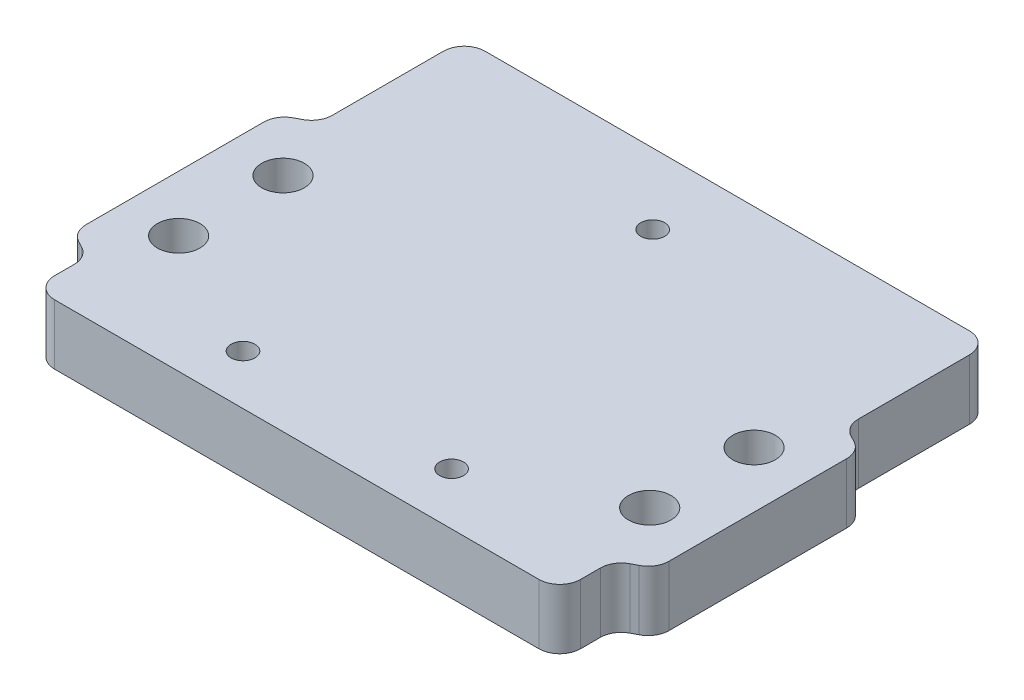
ISO-10303-21;
HEADER;
FILE_DESCRIPTION(('STEP AP214'),'2;1');
FILE_NAME('part.step','',(''),(''),'','','');
FILE_SCHEMA(('AUTOMOTIVE_DESIGN { 1 0 10303 214 1 1 1 1 }'));
ENDSEC;
DATA;
#1=APPLICATION_CONTEXT('core data for automotive mechanical design processes');
#2=APPLICATION_PROTOCOL_DEFINITION('international standard','automotive_design',2000,#1);
#3=PRODUCT_CONTEXT('',#1,'mechanical');
#4=PRODUCT('Part','Part','',(#3));
#5=PRODUCT_RELATED_PRODUCT_CATEGORY('part','',(#4));
#6=PRODUCT_DEFINITION_FORMATION('','',#4);
#7=PRODUCT_DEFINITION_CONTEXT('part definition',#1,'design');
#8=PRODUCT_DEFINITION('design','',#6,#7);
#9=PRODUCT_DEFINITION_SHAPE('','',#8);
#10=(LENGTH_UNIT() NAMED_UNIT(*) SI_UNIT(.MILLI.,.METRE.));
#11=(NAMED_UNIT(*) PLANE_ANGLE_UNIT() SI_UNIT($,.RADIAN.));
#12=(NAMED_UNIT(*) SI_UNIT($,.STERADIAN.) SOLID_ANGLE_UNIT());
#13=UNCERTAINTY_MEASURE_WITH_UNIT(LENGTH_MEASURE(1.E-05),#10,'distance_accuracy_value','');
#14=(GEOMETRIC_REPRESENTATION_CONTEXT(3) GLOBAL_UNCERTAINTY_ASSIGNED_CONTEXT((#13)) GLOBAL_UNIT_ASSIGNED_CONTEXT((#10,
#11,#12)) REPRESENTATION_CONTEXT('',''));
#15=CARTESIAN_POINT('',(0.,0.,0.));
#16=DIRECTION('',(0.,0.,1.));
#17=DIRECTION('',(1.,0.,0.));
#18=AXIS2_PLACEMENT_3D('',#15,#16,#17);
#19=CARTESIAN_POINT('',(0.,7.3152,0.));
#20=DIRECTION('',(0.,1.,0.));
#21=DIRECTION('',(0.,0.,1.));
#22=AXIS2_PLACEMENT_3D('',#19,#20,#21);
#23=PLANE('',#22);
#24=DIRECTION('',(-1.,0.,0.));
#25=VECTOR('',#24,1.);
#26=CARTESIAN_POINT('',(-36.3811986175395,7.3152,20.6430448620664));
#27=LINE('',#26,#25);
#28=CARTESIAN_POINT('',(29.4680176936611,7.3152,20.6430448620664));
#29=VERTEX_POINT('',#28);
#30=CARTESIAN_POINT('',(-29.4680176936611,7.3152,20.6430448620664));
#31=VERTEX_POINT('',#30);
#32=EDGE_CURVE('E437',#29,#31,#27,.T.);
#33=ORIENTED_EDGE('',*,*,#32,.F.);
#34=CARTESIAN_POINT('',(29.4680176936611,7.3152,18.1030448620664));
#35=DIRECTION('',(0.,1.,0.));
#36=DIRECTION('',(0.,0.,1.));
#37=AXIS2_PLACEMENT_3D('',#34,#35,#36);
#38=CIRCLE('',#37,2.54);
#39=CARTESIAN_POINT('',(32.0080176936611,7.3152,18.1030448620664));
#40=VERTEX_POINT('',#39);
#41=EDGE_CURVE('E49',#29,#40,#38,.T.);
#42=ORIENTED_EDGE('',*,*,#41,.T.);
#43=DIRECTION('',(0.,0.,1.));
#44=VECTOR('',#43,1.);
#45=CARTESIAN_POINT('',(32.0080176936611,7.3152,0.));
#46=LINE('',#45,#44);
#47=CARTESIAN_POINT('',(32.0080176936611,7.3152,15.6974481656391));
#48=VERTEX_POINT('',#47);
#49=EDGE_CURVE('E436',#48,#40,#46,.T.);
#50=ORIENTED_EDGE('',*,*,#49,.F.);
#51=CARTESIAN_POINT('',(34.5480176936611,7.3152,15.6974481656391));
#52=DIRECTION('',(0.,1.,0.));
#53=DIRECTION('',(0.,0.,1.));
#54=AXIS2_PLACEMENT_3D('',#51,#52,#53);
#55=CIRCLE('',#54,2.54);
#56=CARTESIAN_POINT('',(33.3763791541453,7.3152,13.443814847479));
#57=VERTEX_POINT('',#56);
#58=EDGE_CURVE('E382',#48,#57,#55,.F.);
#59=ORIENTED_EDGE('',*,*,#58,.T.);
#60=DIRECTION('',(-0.887257211874053,0.,0.461275015557403));
#61=VECTOR('',#60,1.);
#62=CARTESIAN_POINT('',(12.6037915711075,7.3152,24.2432488022558));
#63=LINE('',#62,#61);
#64=CARTESIAN_POINT('',(34.1044985055158,7.3152,13.0652738104085));
#65=VERTEX_POINT('',#64);
#66=EDGE_CURVE('E448',#65,#57,#63,.T.);
#67=ORIENTED_EDGE('',*,*,#66,.F.);
#68=CARTESIAN_POINT('',(32.932859966,7.3152,10.8116404922484));
#69=DIRECTION('',(0.,1.,0.));
#70=DIRECTION('',(0.,0.,1.));
#71=AXIS2_PLACEMENT_3D('',#68,#69,#70);
#72=CIRCLE('',#71,2.54);
#73=CARTESIAN_POINT('',(35.472859966,7.3152,10.8116404922484));
#74=VERTEX_POINT('',#73);
#75=EDGE_CURVE('E340',#65,#74,#72,.T.);
#76=ORIENTED_EDGE('',*,*,#75,.T.);
#77=DIRECTION('',(0.,0.,-1.));
#78=VECTOR('',#77,1.);
#79=CARTESIAN_POINT('',(35.472859966,7.3152,31.75));
#80=LINE('',#79,#78);
#81=CARTESIAN_POINT('',(35.472859966,7.3152,-10.8116404922484));
#82=VERTEX_POINT('',#81);
#83=EDGE_CURVE('E277',#74,#82,#80,.T.);
#84=ORIENTED_EDGE('',*,*,#83,.T.);
#85=CARTESIAN_POINT('',(32.932859966,7.3152,-10.8116404922484));
#86=DIRECTION('',(0.,1.,0.));
#87=DIRECTION('',(0.,0.,1.));
#88=AXIS2_PLACEMENT_3D('',#85,#86,#87);
#89=CIRCLE('',#88,2.54);
#90=CARTESIAN_POINT('',(34.1044985055158,7.3152,-13.0652738104085));
#91=VERTEX_POINT('',#90);
#92=EDGE_CURVE('E213',#82,#91,#89,.T.);
#93=ORIENTED_EDGE('',*,*,#92,.T.);
#94=DIRECTION('',(-0.887257211874053,0.,-0.461275015557403));
#95=VECTOR('',#94,1.);
#96=CARTESIAN_POINT('',(12.6037915711075,7.3152,-24.2432488022558));
#97=LINE('',#96,#95);
#98=CARTESIAN_POINT('',(33.3763791541453,7.3152,-13.443814847479));
#99=VERTEX_POINT('',#98);
#100=EDGE_CURVE('E535',#91,#99,#97,.T.);
#101=ORIENTED_EDGE('',*,*,#100,.T.);
#102=CARTESIAN_POINT('',(34.5480176936611,7.3152,-15.6974481656391));
#103=DIRECTION('',(0.,1.,0.));
#104=DIRECTION('',(0.,0.,1.));
#105=AXIS2_PLACEMENT_3D('',#102,#103,#104);
#106=CIRCLE('',#105,2.54);
#107=CARTESIAN_POINT('',(32.0080176936611,7.3152,-15.6974481656391));
#108=VERTEX_POINT('',#107);
#109=EDGE_CURVE('E330',#99,#108,#106,.F.);
#110=ORIENTED_EDGE('',*,*,#109,.T.);
#111=DIRECTION('',(0.,0.,-1.));
#112=VECTOR('',#111,1.);
#113=CARTESIAN_POINT('',(32.0080176936611,7.3152,0.));
#114=LINE('',#113,#112);
#115=CARTESIAN_POINT('',(32.0080176936611,7.3152,-29.21));
#116=VERTEX_POINT('',#115);
#117=EDGE_CURVE('E531',#108,#116,#114,.T.);
#118=ORIENTED_EDGE('',*,*,#117,.T.);
#119=CARTESIAN_POINT('',(29.4680176936611,7.3152,-29.21));
#120=DIRECTION('',(0.,1.,0.));
#121=DIRECTION('',(0.,0.,1.));
#122=AXIS2_PLACEMENT_3D('',#119,#120,#121);
#123=CIRCLE('',#122,2.54);
#124=CARTESIAN_POINT('',(29.4680176936611,7.3152,-31.75));
#125=VERTEX_POINT('',#124);
#126=EDGE_CURVE('E395',#116,#125,#123,.T.);
#127=ORIENTED_EDGE('',*,*,#126,.T.);
#128=DIRECTION('',(-1.,0.,0.));
#129=VECTOR('',#128,1.);
#130=CARTESIAN_POINT('',(35.472859966,7.3152,-31.75));
#131=LINE('',#130,#129);
#132=CARTESIAN_POINT('',(-29.468017693661,7.3152,-31.75));
#133=VERTEX_POINT('',#132);
#134=EDGE_CURVE('E281',#125,#133,#131,.T.);
#135=ORIENTED_EDGE('',*,*,#134,.T.);
#136=CARTESIAN_POINT('',(-29.4680176936611,7.3152,-29.21));
#137=DIRECTION('',(0.,1.,0.));
#138=DIRECTION('',(0.,0.,1.));
#139=AXIS2_PLACEMENT_3D('',#136,#137,#138);
#140=CIRCLE('',#139,2.54);
#141=CARTESIAN_POINT('',(-32.0080176936611,7.3152,-29.21));
#142=VERTEX_POINT('',#141);
#143=EDGE_CURVE('E392',#133,#142,#140,.T.);
#144=ORIENTED_EDGE('',*,*,#143,.T.);
#145=DIRECTION('',(0.,0.,-1.));
#146=VECTOR('',#145,1.);
#147=CARTESIAN_POINT('',(-32.0080176936611,7.3152,0.));
#148=LINE('',#147,#146);
#149=CARTESIAN_POINT('',(-32.0080176936611,7.3152,-15.6974481656391));
#150=VERTEX_POINT('',#149);
#151=EDGE_CURVE('E230',#150,#142,#148,.T.);
#152=ORIENTED_EDGE('',*,*,#151,.F.);
#153=CARTESIAN_POINT('',(-34.5480176936611,7.3152,-15.6974481656391));
#154=DIRECTION('',(0.,1.,0.));
#155=DIRECTION('',(0.,0.,1.));
#156=AXIS2_PLACEMENT_3D('',#153,#154,#155);
#157=CIRCLE('',#156,2.54);
#158=CARTESIAN_POINT('',(-33.3763791541453,7.3152,-13.443814847479));
#159=VERTEX_POINT('',#158);
#160=EDGE_CURVE('E228',#150,#159,#157,.F.);
#161=ORIENTED_EDGE('',*,*,#160,.T.);
#162=DIRECTION('',(0.887257211874053,0.,-0.461275015557403));
#163=VECTOR('',#162,1.);
#164=CARTESIAN_POINT('',(-12.6037915711075,7.3152,-24.2432488022558));
#165=LINE('',#164,#163);
#166=CARTESIAN_POINT('',(-34.1044985055158,7.3152,-13.0652738104085));
#167=VERTEX_POINT('',#166);
#168=EDGE_CURVE('E219',#167,#159,#165,.T.);
#169=ORIENTED_EDGE('',*,*,#168,.F.);
#170=CARTESIAN_POINT('',(-32.932859966,7.3152,-10.8116404922484));
#171=DIRECTION('',(0.,1.,0.));
#172=DIRECTION('',(0.,0.,1.));
#173=AXIS2_PLACEMENT_3D('',#170,#171,#172);
#174=CIRCLE('',#173,2.54);
#175=CARTESIAN_POINT('',(-35.472859966,7.3152,-10.8116404922484));
#176=VERTEX_POINT('',#175);
#177=EDGE_CURVE('E203',#167,#176,#174,.T.);
#178=ORIENTED_EDGE('',*,*,#177,.T.);
#179=DIRECTION('',(0.,0.,1.));
#180=VECTOR('',#179,1.);
#181=CARTESIAN_POINT('',(-35.472859966,7.3152,31.75));
#182=LINE('',#181,#180);
#183=CARTESIAN_POINT('',(-35.472859966,7.3152,10.8116404922484));
#184=VERTEX_POINT('',#183);
#185=EDGE_CURVE('E274',#176,#184,#182,.T.);
#186=ORIENTED_EDGE('',*,*,#185,.T.);
#187=CARTESIAN_POINT('',(-32.932859966,7.3152,10.8116404922484));
#188=DIRECTION('',(0.,1.,0.));
#189=DIRECTION('',(0.,0.,1.));
#190=AXIS2_PLACEMENT_3D('',#187,#188,#189);
#191=CIRCLE('',#190,2.54);
#192=CARTESIAN_POINT('',(-34.1044985055158,7.3152,13.0652738104085));
#193=VERTEX_POINT('',#192);
#194=EDGE_CURVE('E343',#184,#193,#191,.T.);
#195=ORIENTED_EDGE('',*,*,#194,.T.);
#196=DIRECTION('',(0.887257211874053,0.,0.461275015557403));
#197=VECTOR('',#196,1.);
#198=CARTESIAN_POINT('',(-12.6037915711075,7.3152,24.2432488022558));
#199=LINE('',#198,#197);
#200=CARTESIAN_POINT('',(-33.3763791541453,7.3152,13.443814847479));
#201=VERTEX_POINT('',#200);
#202=EDGE_CURVE('E519',#193,#201,#199,.T.);
#203=ORIENTED_EDGE('',*,*,#202,.T.);
#204=CARTESIAN_POINT('',(-34.5480176936611,7.3152,15.6974481656391));
#205=DIRECTION('',(0.,1.,0.));
#206=DIRECTION('',(0.,0.,1.));
#207=AXIS2_PLACEMENT_3D('',#204,#205,#206);
#208=CIRCLE('',#207,2.54);
#209=CARTESIAN_POINT('',(-32.0080176936611,7.3152,15.6974481656391));
#210=VERTEX_POINT('',#209);
#211=EDGE_CURVE('E376',#201,#210,#208,.F.);
#212=ORIENTED_EDGE('',*,*,#211,.T.);
#213=DIRECTION('',(0.,0.,1.));
#214=VECTOR('',#213,1.);
#215=CARTESIAN_POINT('',(-32.0080176936611,7.3152,0.));
#216=LINE('',#215,#214);
#217=CARTESIAN_POINT('',(-32.0080176936611,7.3152,18.1030448620664));
#218=VERTEX_POINT('',#217);
#219=EDGE_CURVE('E516',#210,#218,#216,.T.);
#220=ORIENTED_EDGE('',*,*,#219,.T.);
#221=CARTESIAN_POINT('',(-29.4680176936611,7.3152,18.1030448620664));
#222=DIRECTION('',(0.,1.,0.));
#223=DIRECTION('',(0.,0.,1.));
#224=AXIS2_PLACEMENT_3D('',#221,#222,#223);
#225=CIRCLE('',#224,2.54);
#226=EDGE_CURVE('E61',#218,#31,#225,.T.);
#227=ORIENTED_EDGE('',*,*,#226,.T.);
#228=EDGE_LOOP('',(#33,#42,#50,#59,#67,#76,#84,#93,#101,#110,#118,#127,#135,#144,#152,#161,#169,
#178,#186,#195,#203,#212,#220,#227));
#229=FACE_BOUND('',#228,.T.);
#230=CARTESIAN_POINT('',(12.4986960237432,7.3152,14.3011286735226));
#231=DIRECTION('',(0.,-1.,0.));
#232=DIRECTION('',(0.,0.,-1.));
#233=AXIS2_PLACEMENT_3D('',#230,#231,#232);
#234=CIRCLE('',#233,1.45);
#235=CARTESIAN_POINT('',(12.4986960237432,7.3152,12.8511286735226));
#236=VERTEX_POINT('',#235);
#237=EDGE_CURVE('E473',#236,#236,#234,.T.);
#238=ORIENTED_EDGE('',*,*,#237,.T.);
#239=EDGE_LOOP('',(#238));
#240=FACE_BOUND('',#239,.T.);
#241=CARTESIAN_POINT('',(-12.59967499821,7.3152,14.5870867899943));
#242=DIRECTION('',(0.,-1.,0.));
#243=DIRECTION('',(0.,0.,-1.));
#244=AXIS2_PLACEMENT_3D('',#241,#242,#243);
#245=CIRCLE('',#244,1.45);
#246=CARTESIAN_POINT('',(-12.59967499821,7.3152,13.1370867899943));
#247=VERTEX_POINT('',#246);
#248=EDGE_CURVE('E485',#247,#247,#245,.T.);
#249=ORIENTED_EDGE('',*,*,#248,.T.);
#250=EDGE_LOOP('',(#249));
#251=FACE_BOUND('',#250,.T.);
#252=CARTESIAN_POINT('',(-0.478857024258712,7.3152,-23.1534520461477));
#253=DIRECTION('',(0.,-1.,0.));
#254=DIRECTION('',(0.,0.,-1.));
#255=AXIS2_PLACEMENT_3D('',#252,#253,#254);
#256=CIRCLE('',#255,1.45);
#257=CARTESIAN_POINT('',(-0.478857024258712,7.3152,-24.6034520461477));
#258=VERTEX_POINT('',#257);
#259=EDGE_CURVE('E497',#258,#258,#256,.T.);
#260=ORIENTED_EDGE('',*,*,#259,.T.);
#261=EDGE_LOOP('',(#260));
#262=FACE_BOUND('',#261,.T.);
#263=CARTESIAN_POINT('',(28.662459966,7.3152,6.35));
#264=DIRECTION('',(0.,1.,0.));
#265=DIRECTION('',(0.,0.,1.));
#266=AXIS2_PLACEMENT_3D('',#263,#264,#265);
#267=CIRCLE('',#266,2.59079999999999);
#268=CARTESIAN_POINT('',(28.662459966,7.3152,8.94079999999999));
#269=VERTEX_POINT('',#268);
#270=EDGE_CURVE('E236',#269,#269,#267,.T.);
#271=ORIENTED_EDGE('',*,*,#270,.F.);
#272=EDGE_LOOP('',(#271));
#273=FACE_BOUND('',#272,.T.);
#274=CARTESIAN_POINT('',(28.662459966,7.3152,-6.35));
#275=DIRECTION('',(0.,1.,0.));
#276=DIRECTION('',(0.,0.,1.));
#277=AXIS2_PLACEMENT_3D('',#274,#275,#276);
#278=CIRCLE('',#277,2.59079999999999);
#279=CARTESIAN_POINT('',(28.662459966,7.3152,-3.75920000000001));
#280=VERTEX_POINT('',#279);
#281=EDGE_CURVE('E249',#280,#280,#278,.T.);
#282=ORIENTED_EDGE('',*,*,#281,.F.);
#283=EDGE_LOOP('',(#282));
#284=FACE_BOUND('',#283,.T.);
#285=CARTESIAN_POINT('',(-28.662459966,7.3152,6.35));
#286=DIRECTION('',(0.,1.,0.));
#287=DIRECTION('',(0.,0.,1.));
#288=AXIS2_PLACEMENT_3D('',#285,#286,#287);
#289=CIRCLE('',#288,2.59079999999999);
#290=CARTESIAN_POINT('',(-28.662459966,7.3152,8.94079999999999));
#291=VERTEX_POINT('',#290);
#292=EDGE_CURVE('E257',#291,#291,#289,.T.);
#293=ORIENTED_EDGE('',*,*,#292,.F.);
#294=EDGE_LOOP('',(#293));
#295=FACE_BOUND('',#294,.T.);
#296=CARTESIAN_POINT('',(-28.662459966,7.3152,-6.35));
#297=DIRECTION('',(0.,1.,0.));
#298=DIRECTION('',(0.,0.,1.));
#299=AXIS2_PLACEMENT_3D('',#296,#297,#298);
#300=CIRCLE('',#299,2.59079999999999);
#301=CARTESIAN_POINT('',(-28.662459966,7.3152,-3.75920000000001));
#302=VERTEX_POINT('',#301);
#303=EDGE_CURVE('E265',#302,#302,#300,.T.);
#304=ORIENTED_EDGE('',*,*,#303,.F.);
#305=EDGE_LOOP('',(#304));
#306=FACE_BOUND('',#305,.T.);
#307=ADVANCED_FACE('F40',(#229,#240,#251,#262,#273,#284,#295,#306),#23,.T.);
#308=CARTESIAN_POINT('',(0.,0.,0.));
#309=DIRECTION('',(0.,1.,0.));
#310=DIRECTION('',(0.,0.,1.));
#311=AXIS2_PLACEMENT_3D('',#308,#309,#310);
#312=PLANE('',#311);
#313=CARTESIAN_POINT('',(12.4986960237432,0.,14.3011286735226));
#314=DIRECTION('',(0.,-1.,0.));
#315=DIRECTION('',(0.,0.,-1.));
#316=AXIS2_PLACEMENT_3D('',#313,#314,#315);
#317=CIRCLE('',#316,2.75);
#318=CARTESIAN_POINT('',(12.4986960237432,0.,11.5511286735226));
#319=VERTEX_POINT('',#318);
#320=EDGE_CURVE('E461',#319,#319,#317,.T.);
#321=ORIENTED_EDGE('',*,*,#320,.F.);
#322=EDGE_LOOP('',(#321));
#323=FACE_BOUND('',#322,.T.);
#324=CARTESIAN_POINT('',(-12.59967499821,0.,14.5870867899943));
#325=DIRECTION('',(0.,-1.,0.));
#326=DIRECTION('',(0.,0.,-1.));
#327=AXIS2_PLACEMENT_3D('',#324,#325,#326);
#328=CIRCLE('',#327,2.75);
#329=CARTESIAN_POINT('',(-12.59967499821,0.,11.8370867899943));
#330=VERTEX_POINT('',#329);
#331=EDGE_CURVE('E477',#330,#330,#328,.T.);
#332=ORIENTED_EDGE('',*,*,#331,.F.);
#333=EDGE_LOOP('',(#332));
#334=FACE_BOUND('',#333,.T.);
#335=CARTESIAN_POINT('',(-0.478857024258712,0.,-23.1534520461477));
#336=DIRECTION('',(0.,-1.,0.));
#337=DIRECTION('',(0.,0.,-1.));
#338=AXIS2_PLACEMENT_3D('',#335,#336,#337);
#339=CIRCLE('',#338,2.75);
#340=CARTESIAN_POINT('',(-0.478857024258712,0.,-25.9034520461477));
#341=VERTEX_POINT('',#340);
#342=EDGE_CURVE('E489',#341,#341,#339,.T.);
#343=ORIENTED_EDGE('',*,*,#342,.F.);
#344=EDGE_LOOP('',(#343));
#345=FACE_BOUND('',#344,.T.);
#346=CARTESIAN_POINT('',(28.662459966,0.,6.35));
#347=DIRECTION('',(0.,1.,0.));
#348=DIRECTION('',(0.,0.,1.));
#349=AXIS2_PLACEMENT_3D('',#346,#347,#348);
#350=CIRCLE('',#349,2.5908);
#351=CARTESIAN_POINT('',(28.662459966,0.,8.9408));
#352=VERTEX_POINT('',#351);
#353=EDGE_CURVE('E245',#352,#352,#350,.T.);
#354=ORIENTED_EDGE('',*,*,#353,.T.);
#355=EDGE_LOOP('',(#354));
#356=FACE_BOUND('',#355,.T.);
#357=CARTESIAN_POINT('',(28.662459966,0.,-6.35));
#358=DIRECTION('',(0.,1.,0.));
#359=DIRECTION('',(0.,0.,1.));
#360=AXIS2_PLACEMENT_3D('',#357,#358,#359);
#361=CIRCLE('',#360,2.5908);
#362=CARTESIAN_POINT('',(28.662459966,0.,-3.7592));
#363=VERTEX_POINT('',#362);
#364=EDGE_CURVE('E253',#363,#363,#361,.T.);
#365=ORIENTED_EDGE('',*,*,#364,.T.);
#366=EDGE_LOOP('',(#365));
#367=FACE_BOUND('',#366,.T.);
#368=CARTESIAN_POINT('',(-28.662459966,0.,6.35));
#369=DIRECTION('',(0.,1.,0.));
#370=DIRECTION('',(0.,0.,1.));
#371=AXIS2_PLACEMENT_3D('',#368,#369,#370);
#372=CIRCLE('',#371,2.5908);
#373=CARTESIAN_POINT('',(-28.662459966,0.,8.9408));
#374=VERTEX_POINT('',#373);
#375=EDGE_CURVE('E261',#374,#374,#372,.T.);
#376=ORIENTED_EDGE('',*,*,#375,.T.);
#377=EDGE_LOOP('',(#376));
#378=FACE_BOUND('',#377,.T.);
#379=CARTESIAN_POINT('',(-28.662459966,0.,-6.35));
#380=DIRECTION('',(0.,1.,0.));
#381=DIRECTION('',(0.,0.,1.));
#382=AXIS2_PLACEMENT_3D('',#379,#380,#381);
#383=CIRCLE('',#382,2.5908);
#384=CARTESIAN_POINT('',(-28.662459966,0.,-3.7592));
#385=VERTEX_POINT('',#384);
#386=EDGE_CURVE('E269',#385,#385,#383,.T.);
#387=ORIENTED_EDGE('',*,*,#386,.T.);
#388=EDGE_LOOP('',(#387));
#389=FACE_BOUND('',#388,.T.);
#390=DIRECTION('',(0.,0.,1.));
#391=VECTOR('',#390,1.);
#392=CARTESIAN_POINT('',(32.0080176936611,0.,14.1552105346888));
#393=LINE('',#392,#391);
#394=CARTESIAN_POINT('',(32.0080176936611,0.,15.6974481656391));
#395=VERTEX_POINT('',#394);
#396=CARTESIAN_POINT('',(32.0080176936611,0.,18.1030448620664));
#397=VERTEX_POINT('',#396);
#398=EDGE_CURVE('E456',#395,#397,#393,.T.);
#399=ORIENTED_EDGE('',*,*,#398,.T.);
#400=CARTESIAN_POINT('',(29.4680176936611,0.,18.1030448620664));
#401=DIRECTION('',(0.,1.,0.));
#402=DIRECTION('',(0.,0.,1.));
#403=AXIS2_PLACEMENT_3D('',#400,#401,#402);
#404=CIRCLE('',#403,2.54);
#405=CARTESIAN_POINT('',(29.4680176936611,0.,20.6430448620664));
#406=VERTEX_POINT('',#405);
#407=EDGE_CURVE('E421',#397,#406,#404,.F.);
#408=ORIENTED_EDGE('',*,*,#407,.T.);
#409=DIRECTION('',(-1.,0.,0.));
#410=VECTOR('',#409,1.);
#411=CARTESIAN_POINT('',(-36.3811986175395,0.,20.6430448620664));
#412=LINE('',#411,#410);
#413=CARTESIAN_POINT('',(-29.4680176936611,0.,20.6430448620664));
#414=VERTEX_POINT('',#413);
#415=EDGE_CURVE('E455',#406,#414,#412,.T.);
#416=ORIENTED_EDGE('',*,*,#415,.T.);
#417=CARTESIAN_POINT('',(-29.4680176936611,0.,18.1030448620664));
#418=DIRECTION('',(0.,1.,0.));
#419=DIRECTION('',(0.,0.,1.));
#420=AXIS2_PLACEMENT_3D('',#417,#418,#419);
#421=CIRCLE('',#420,2.54);
#422=CARTESIAN_POINT('',(-32.0080176936611,0.,18.1030448620664));
#423=VERTEX_POINT('',#422);
#424=EDGE_CURVE('E418',#414,#423,#421,.F.);
#425=ORIENTED_EDGE('',*,*,#424,.T.);
#426=DIRECTION('',(0.,0.,1.));
#427=VECTOR('',#426,1.);
#428=CARTESIAN_POINT('',(-32.0080176936611,0.,14.1552105346888));
#429=LINE('',#428,#427);
#430=CARTESIAN_POINT('',(-32.0080176936611,0.,15.6974481656391));
#431=VERTEX_POINT('',#430);
#432=EDGE_CURVE('E447',#431,#423,#429,.T.);
#433=ORIENTED_EDGE('',*,*,#432,.F.);
#434=CARTESIAN_POINT('',(-34.5480176936611,0.,15.6974481656391));
#435=DIRECTION('',(0.,1.,0.));
#436=DIRECTION('',(0.,0.,1.));
#437=AXIS2_PLACEMENT_3D('',#434,#435,#436);
#438=CIRCLE('',#437,2.54);
#439=CARTESIAN_POINT('',(-33.3763791541453,0.,13.443814847479));
#440=VERTEX_POINT('',#439);
#441=EDGE_CURVE('E379',#431,#440,#438,.T.);
#442=ORIENTED_EDGE('',*,*,#441,.T.);
#443=DIRECTION('',(0.887257211874052,0.,0.461275015557403));
#444=VECTOR('',#443,1.);
#445=CARTESIAN_POINT('',(-35.472859966,0.,12.3538781231987));
#446=LINE('',#445,#444);
#447=CARTESIAN_POINT('',(-34.1044985055158,0.,13.0652738104085));
#448=VERTEX_POINT('',#447);
#449=EDGE_CURVE('E512',#448,#440,#446,.T.);
#450=ORIENTED_EDGE('',*,*,#449,.F.);
#451=CARTESIAN_POINT('',(-32.932859966,0.,10.8116404922484));
#452=DIRECTION('',(0.,1.,0.));
#453=DIRECTION('',(0.,0.,1.));
#454=AXIS2_PLACEMENT_3D('',#451,#452,#453);
#455=CIRCLE('',#454,2.54);
#456=CARTESIAN_POINT('',(-35.472859966,0.,10.8116404922484));
#457=VERTEX_POINT('',#456);
#458=EDGE_CURVE('E356',#448,#457,#455,.F.);
#459=ORIENTED_EDGE('',*,*,#458,.T.);
#460=DIRECTION('',(0.,0.,1.));
#461=VECTOR('',#460,1.);
#462=CARTESIAN_POINT('',(-35.472859966,0.,31.75));
#463=LINE('',#462,#461);
#464=CARTESIAN_POINT('',(-35.472859966,0.,-10.8116404922484));
#465=VERTEX_POINT('',#464);
#466=EDGE_CURVE('E273',#465,#457,#463,.T.);
#467=ORIENTED_EDGE('',*,*,#466,.F.);
#468=CARTESIAN_POINT('',(-32.932859966,0.,-10.8116404922484));
#469=DIRECTION('',(0.,1.,0.));
#470=DIRECTION('',(0.,0.,1.));
#471=AXIS2_PLACEMENT_3D('',#468,#469,#470);
#472=CIRCLE('',#471,2.54);
#473=CARTESIAN_POINT('',(-34.1044985055158,0.,-13.0652738104085));
#474=VERTEX_POINT('',#473);
#475=EDGE_CURVE('E304',#465,#474,#472,.F.);
#476=ORIENTED_EDGE('',*,*,#475,.T.);
#477=DIRECTION('',(0.887257211874052,0.,-0.461275015557403));
#478=VECTOR('',#477,1.);
#479=CARTESIAN_POINT('',(-35.472859966,0.,-12.3538781231987));
#480=LINE('',#479,#478);
#481=CARTESIAN_POINT('',(-33.3763791541453,0.,-13.443814847479));
#482=VERTEX_POINT('',#481);
#483=EDGE_CURVE('E222',#474,#482,#480,.T.);
#484=ORIENTED_EDGE('',*,*,#483,.T.);
#485=CARTESIAN_POINT('',(-34.5480176936611,0.,-15.6974481656391));
#486=DIRECTION('',(0.,1.,0.));
#487=DIRECTION('',(0.,0.,1.));
#488=AXIS2_PLACEMENT_3D('',#485,#486,#487);
#489=CIRCLE('',#488,2.54);
#490=CARTESIAN_POINT('',(-32.0080176936611,0.,-15.6974481656391));
#491=VERTEX_POINT('',#490);
#492=EDGE_CURVE('E327',#482,#491,#489,.T.);
#493=ORIENTED_EDGE('',*,*,#492,.T.);
#494=DIRECTION('',(0.,0.,-1.));
#495=VECTOR('',#494,1.);
#496=CARTESIAN_POINT('',(-32.0080176936611,0.,-14.1552105346888));
#497=LINE('',#496,#495);
#498=CARTESIAN_POINT('',(-32.0080176936611,0.,-29.21));
#499=VERTEX_POINT('',#498);
#500=EDGE_CURVE('E231',#491,#499,#497,.T.);
#501=ORIENTED_EDGE('',*,*,#500,.T.);
#502=CARTESIAN_POINT('',(-29.4680176936611,0.,-29.21));
#503=DIRECTION('',(0.,1.,0.));
#504=DIRECTION('',(0.,0.,1.));
#505=AXIS2_PLACEMENT_3D('',#502,#503,#504);
#506=CIRCLE('',#505,2.54);
#507=CARTESIAN_POINT('',(-29.468017693661,0.,-31.75));
#508=VERTEX_POINT('',#507);
#509=EDGE_CURVE('E405',#499,#508,#506,.F.);
#510=ORIENTED_EDGE('',*,*,#509,.T.);
#511=DIRECTION('',(-1.,0.,0.));
#512=VECTOR('',#511,1.);
#513=CARTESIAN_POINT('',(35.472859966,0.,-31.75));
#514=LINE('',#513,#512);
#515=CARTESIAN_POINT('',(29.4680176936611,0.,-31.75));
#516=VERTEX_POINT('',#515);
#517=EDGE_CURVE('E278',#516,#508,#514,.T.);
#518=ORIENTED_EDGE('',*,*,#517,.F.);
#519=CARTESIAN_POINT('',(29.4680176936611,0.,-29.21));
#520=DIRECTION('',(0.,1.,0.));
#521=DIRECTION('',(0.,0.,1.));
#522=AXIS2_PLACEMENT_3D('',#519,#520,#521);
#523=CIRCLE('',#522,2.54);
#524=CARTESIAN_POINT('',(32.0080176936611,0.,-29.21));
#525=VERTEX_POINT('',#524);
#526=EDGE_CURVE('E408',#516,#525,#523,.F.);
#527=ORIENTED_EDGE('',*,*,#526,.T.);
#528=DIRECTION('',(0.,0.,-1.));
#529=VECTOR('',#528,1.);
#530=CARTESIAN_POINT('',(32.0080176936611,0.,-14.1552105346888));
#531=LINE('',#530,#529);
#532=CARTESIAN_POINT('',(32.0080176936611,0.,-15.6974481656391));
#533=VERTEX_POINT('',#532);
#534=EDGE_CURVE('E523',#533,#525,#531,.T.);
#535=ORIENTED_EDGE('',*,*,#534,.F.);
#536=CARTESIAN_POINT('',(34.5480176936611,0.,-15.6974481656391));
#537=DIRECTION('',(0.,1.,0.));
#538=DIRECTION('',(0.,0.,1.));
#539=AXIS2_PLACEMENT_3D('',#536,#537,#538);
#540=CIRCLE('',#539,2.54);
#541=CARTESIAN_POINT('',(33.3763791541453,0.,-13.443814847479));
#542=VERTEX_POINT('',#541);
#543=EDGE_CURVE('E333',#533,#542,#540,.T.);
#544=ORIENTED_EDGE('',*,*,#543,.T.);
#545=DIRECTION('',(-0.887257211874052,0.,-0.461275015557403));
#546=VECTOR('',#545,1.);
#547=CARTESIAN_POINT('',(35.472859966,0.,-12.3538781231987));
#548=LINE('',#547,#546);
#549=CARTESIAN_POINT('',(34.1044985055158,0.,-13.0652738104085));
#550=VERTEX_POINT('',#549);
#551=EDGE_CURVE('E527',#550,#542,#548,.T.);
#552=ORIENTED_EDGE('',*,*,#551,.F.);
#553=CARTESIAN_POINT('',(32.932859966,0.,-10.8116404922484));
#554=DIRECTION('',(0.,1.,0.));
#555=DIRECTION('',(0.,0.,1.));
#556=AXIS2_PLACEMENT_3D('',#553,#554,#555);
#557=CIRCLE('',#556,2.54);
#558=CARTESIAN_POINT('',(35.472859966,0.,-10.8116404922484));
#559=VERTEX_POINT('',#558);
#560=EDGE_CURVE('E300',#550,#559,#557,.F.);
#561=ORIENTED_EDGE('',*,*,#560,.T.);
#562=DIRECTION('',(0.,0.,-1.));
#563=VECTOR('',#562,1.);
#564=CARTESIAN_POINT('',(35.472859966,0.,31.75));
#565=LINE('',#564,#563);
#566=CARTESIAN_POINT('',(35.472859966,0.,10.8116404922484));
#567=VERTEX_POINT('',#566);
#568=EDGE_CURVE('E288',#567,#559,#565,.T.);
#569=ORIENTED_EDGE('',*,*,#568,.F.);
#570=CARTESIAN_POINT('',(32.932859966,0.,10.8116404922484));
#571=DIRECTION('',(0.,1.,0.));
#572=DIRECTION('',(0.,0.,1.));
#573=AXIS2_PLACEMENT_3D('',#570,#571,#572);
#574=CIRCLE('',#573,2.54);
#575=CARTESIAN_POINT('',(34.1044985055158,0.,13.0652738104085));
#576=VERTEX_POINT('',#575);
#577=EDGE_CURVE('E353',#567,#576,#574,.F.);
#578=ORIENTED_EDGE('',*,*,#577,.T.);
#579=DIRECTION('',(-0.887257211874052,0.,0.461275015557403));
#580=VECTOR('',#579,1.);
#581=CARTESIAN_POINT('',(35.472859966,0.,12.3538781231987));
#582=LINE('',#581,#580);
#583=CARTESIAN_POINT('',(33.3763791541453,0.,13.443814847479));
#584=VERTEX_POINT('',#583);
#585=EDGE_CURVE('E501',#576,#584,#582,.T.);
#586=ORIENTED_EDGE('',*,*,#585,.T.);
#587=CARTESIAN_POINT('',(34.5480176936611,0.,15.6974481656391));
#588=DIRECTION('',(0.,1.,0.));
#589=DIRECTION('',(0.,0.,1.));
#590=AXIS2_PLACEMENT_3D('',#587,#588,#589);
#591=CIRCLE('',#590,2.54);
#592=EDGE_CURVE('E385',#584,#395,#591,.T.);
#593=ORIENTED_EDGE('',*,*,#592,.T.);
#594=EDGE_LOOP('',(#399,#408,#416,#425,#433,#442,#450,#459,#467,#476,#484,#493,#501,#510,#518,
#527,#535,#544,#552,#561,#569,#578,#586,#593));
#595=FACE_BOUND('',#594,.T.);
#596=ADVANCED_FACE('F454',(#323,#334,#345,#356,#367,#378,#389,#595),#312,.F.);
#597=CARTESIAN_POINT('',(-35.472859966,7.3152,31.75));
#598=DIRECTION('',(1.,0.,0.));
#599=DIRECTION('',(0.,0.,-1.));
#600=AXIS2_PLACEMENT_3D('',#597,#598,#599);
#601=PLANE('',#600);
#602=ORIENTED_EDGE('',*,*,#466,.T.);
#603=DIRECTION('',(0.,1.,0.));
#604=VECTOR('',#603,1.);
#605=CARTESIAN_POINT('',(-35.472859966,7.3152,10.8116404922484));
#606=LINE('',#605,#604);
#607=EDGE_CURVE('E336',#457,#184,#606,.T.);
#608=ORIENTED_EDGE('',*,*,#607,.T.);
#609=ORIENTED_EDGE('',*,*,#185,.F.);
#610=DIRECTION('',(0.,1.,0.));
#611=VECTOR('',#610,1.);
#612=CARTESIAN_POINT('',(-35.472859966,7.3152,-10.8116404922484));
#613=LINE('',#612,#611);
#614=EDGE_CURVE('E208',#176,#465,#613,.F.);
#615=ORIENTED_EDGE('',*,*,#614,.T.);
#616=EDGE_LOOP('',(#602,#608,#609,#615));
#617=FACE_BOUND('',#616,.T.);
#618=ADVANCED_FACE('F616',(#617),#601,.F.);
#619=CARTESIAN_POINT('',(35.472859966,7.3152,31.75));
#620=DIRECTION('',(-1.,0.,0.));
#621=DIRECTION('',(0.,0.,1.));
#622=AXIS2_PLACEMENT_3D('',#619,#620,#621);
#623=PLANE('',#622);
#624=ORIENTED_EDGE('',*,*,#83,.F.);
#625=DIRECTION('',(0.,1.,0.));
#626=VECTOR('',#625,1.);
#627=CARTESIAN_POINT('',(35.472859966,7.3152,10.8116404922484));
#628=LINE('',#627,#626);
#629=EDGE_CURVE('E369',#74,#567,#628,.F.);
#630=ORIENTED_EDGE('',*,*,#629,.T.);
#631=ORIENTED_EDGE('',*,*,#568,.T.);
#632=DIRECTION('',(0.,1.,0.));
#633=VECTOR('',#632,1.);
#634=CARTESIAN_POINT('',(35.472859966,7.3152,-10.8116404922484));
#635=LINE('',#634,#633);
#636=EDGE_CURVE('E311',#559,#82,#635,.T.);
#637=ORIENTED_EDGE('',*,*,#636,.T.);
#638=EDGE_LOOP('',(#624,#630,#631,#637));
#639=FACE_BOUND('',#638,.T.);
#640=ADVANCED_FACE('F583',(#639),#623,.F.);
#641=CARTESIAN_POINT('',(35.472859966,7.3152,-31.75));
#642=DIRECTION('',(0.,0.,1.));
#643=DIRECTION('',(1.,0.,0.));
#644=AXIS2_PLACEMENT_3D('',#641,#642,#643);
#645=PLANE('',#644);
#646=ORIENTED_EDGE('',*,*,#134,.F.);
#647=DIRECTION('',(0.,1.,0.));
#648=VECTOR('',#647,1.);
#649=CARTESIAN_POINT('',(29.4680176936611,0.,-31.75));
#650=LINE('',#649,#648);
#651=EDGE_CURVE('E402',#125,#516,#650,.F.);
#652=ORIENTED_EDGE('',*,*,#651,.T.);
#653=ORIENTED_EDGE('',*,*,#517,.T.);
#654=DIRECTION('',(0.,1.,0.));
#655=VECTOR('',#654,1.);
#656=CARTESIAN_POINT('',(-29.4680176936611,7.3152,-31.75));
#657=LINE('',#656,#655);
#658=EDGE_CURVE('E398',#508,#133,#657,.T.);
#659=ORIENTED_EDGE('',*,*,#658,.T.);
#660=EDGE_LOOP('',(#646,#652,#653,#659));
#661=FACE_BOUND('',#660,.T.);
#662=ADVANCED_FACE('F554',(#661),#645,.F.);
#663=CARTESIAN_POINT('',(-28.662459966,7.3152,-6.35));
#664=DIRECTION('',(0.,1.,0.));
#665=DIRECTION('',(0.,0.,1.));
#666=AXIS2_PLACEMENT_3D('',#663,#664,#665);
#667=CYLINDRICAL_SURFACE('',#666,2.59079999999999);
#668=ORIENTED_EDGE('',*,*,#386,.F.);
#669=EDGE_LOOP('',(#668));
#670=FACE_BOUND('',#669,.T.);
#671=ORIENTED_EDGE('',*,*,#303,.T.);
#672=EDGE_LOOP('',(#671));
#673=FACE_BOUND('',#672,.T.);
#674=ADVANCED_FACE('F620',(#670,#673),#667,.F.);
#675=CARTESIAN_POINT('',(-28.662459966,7.3152,6.35));
#676=DIRECTION('',(0.,1.,0.));
#677=DIRECTION('',(0.,0.,1.));
#678=AXIS2_PLACEMENT_3D('',#675,#676,#677);
#679=CYLINDRICAL_SURFACE('',#678,2.59079999999999);
#680=ORIENTED_EDGE('',*,*,#375,.F.);
#681=EDGE_LOOP('',(#680));
#682=FACE_BOUND('',#681,.T.);
#683=ORIENTED_EDGE('',*,*,#292,.T.);
#684=EDGE_LOOP('',(#683));
#685=FACE_BOUND('',#684,.T.);
#686=ADVANCED_FACE('F718',(#682,#685),#679,.F.);
#687=CARTESIAN_POINT('',(28.662459966,7.3152,-6.35));
#688=DIRECTION('',(0.,1.,0.));
#689=DIRECTION('',(0.,0.,1.));
#690=AXIS2_PLACEMENT_3D('',#687,#688,#689);
#691=CYLINDRICAL_SURFACE('',#690,2.59079999999999);
#692=ORIENTED_EDGE('',*,*,#364,.F.);
#693=EDGE_LOOP('',(#692));
#694=FACE_BOUND('',#693,.T.);
#695=ORIENTED_EDGE('',*,*,#281,.T.);
#696=EDGE_LOOP('',(#695));
#697=FACE_BOUND('',#696,.T.);
#698=ADVANCED_FACE('F715',(#694,#697),#691,.F.);
#699=CARTESIAN_POINT('',(28.662459966,7.3152,6.35));
#700=DIRECTION('',(0.,1.,0.));
#701=DIRECTION('',(0.,0.,1.));
#702=AXIS2_PLACEMENT_3D('',#699,#700,#701);
#703=CYLINDRICAL_SURFACE('',#702,2.59079999999999);
#704=ORIENTED_EDGE('',*,*,#353,.F.);
#705=EDGE_LOOP('',(#704));
#706=FACE_BOUND('',#705,.T.);
#707=ORIENTED_EDGE('',*,*,#270,.T.);
#708=EDGE_LOOP('',(#707));
#709=FACE_BOUND('',#708,.T.);
#710=ADVANCED_FACE('F710',(#706,#709),#703,.F.);
#711=CARTESIAN_POINT('',(-32.0080176936611,0.,-14.1552105346888));
#712=DIRECTION('',(1.,0.,0.));
#713=DIRECTION('',(0.,0.,-1.));
#714=AXIS2_PLACEMENT_3D('',#711,#712,#713);
#715=PLANE('',#714);
#716=ORIENTED_EDGE('',*,*,#151,.T.);
#717=DIRECTION('',(0.,1.,0.));
#718=VECTOR('',#717,1.);
#719=CARTESIAN_POINT('',(-32.0080176936611,0.,-29.21));
#720=LINE('',#719,#718);
#721=EDGE_CURVE('E411',#142,#499,#720,.F.);
#722=ORIENTED_EDGE('',*,*,#721,.T.);
#723=ORIENTED_EDGE('',*,*,#500,.F.);
#724=DIRECTION('',(0.,1.,0.));
#725=VECTOR('',#724,1.);
#726=CARTESIAN_POINT('',(-32.0080176936611,7.3152,-15.6974481656391));
#727=LINE('',#726,#725);
#728=EDGE_CURVE('E307',#491,#150,#727,.T.);
#729=ORIENTED_EDGE('',*,*,#728,.T.);
#730=EDGE_LOOP('',(#716,#722,#723,#729));
#731=FACE_BOUND('',#730,.T.);
#732=ADVANCED_FACE('F546',(#731),#715,.F.);
#733=CARTESIAN_POINT('',(-35.472859966,0.,-12.3538781231987));
#734=DIRECTION('',(0.461275015557403,0.,0.887257211874052));
#735=DIRECTION('',(0.887257211874053,0.,-0.461275015557403));
#736=AXIS2_PLACEMENT_3D('',#733,#734,#735);
#737=PLANE('',#736);
#738=ORIENTED_EDGE('',*,*,#483,.F.);
#739=DIRECTION('',(0.,1.,0.));
#740=VECTOR('',#739,1.);
#741=CARTESIAN_POINT('',(-34.1044985055158,0.,-13.0652738104085));
#742=LINE('',#741,#740);
#743=EDGE_CURVE('E207',#474,#167,#742,.T.);
#744=ORIENTED_EDGE('',*,*,#743,.T.);
#745=ORIENTED_EDGE('',*,*,#168,.T.);
#746=DIRECTION('',(0.,1.,0.));
#747=VECTOR('',#746,1.);
#748=CARTESIAN_POINT('',(-33.3763791541453,0.,-13.443814847479));
#749=LINE('',#748,#747);
#750=EDGE_CURVE('E224',#159,#482,#749,.F.);
#751=ORIENTED_EDGE('',*,*,#750,.T.);
#752=EDGE_LOOP('',(#738,#744,#745,#751));
#753=FACE_BOUND('',#752,.T.);
#754=ADVANCED_FACE('F218',(#753),#737,.F.);
#755=CARTESIAN_POINT('',(35.472859966,0.,-12.3538781231987));
#756=DIRECTION('',(0.461275015557403,0.,-0.887257211874052));
#757=DIRECTION('',(-0.887257211874053,0.,-0.461275015557403));
#758=AXIS2_PLACEMENT_3D('',#755,#756,#757);
#759=PLANE('',#758);
#760=ORIENTED_EDGE('',*,*,#100,.F.);
#761=DIRECTION('',(0.,1.,0.));
#762=VECTOR('',#761,1.);
#763=CARTESIAN_POINT('',(34.1044985055158,0.,-13.0652738104085));
#764=LINE('',#763,#762);
#765=EDGE_CURVE('E319',#91,#550,#764,.F.);
#766=ORIENTED_EDGE('',*,*,#765,.T.);
#767=ORIENTED_EDGE('',*,*,#551,.T.);
#768=DIRECTION('',(0.,1.,0.));
#769=VECTOR('',#768,1.);
#770=CARTESIAN_POINT('',(33.3763791541453,7.3152,-13.443814847479));
#771=LINE('',#770,#769);
#772=EDGE_CURVE('E315',#542,#99,#771,.T.);
#773=ORIENTED_EDGE('',*,*,#772,.T.);
#774=EDGE_LOOP('',(#760,#766,#767,#773));
#775=FACE_BOUND('',#774,.T.);
#776=ADVANCED_FACE('F572',(#775),#759,.T.);
#777=CARTESIAN_POINT('',(32.0080176936611,0.,-14.1552105346888));
#778=DIRECTION('',(1.,0.,0.));
#779=DIRECTION('',(0.,0.,-1.));
#780=AXIS2_PLACEMENT_3D('',#777,#778,#779);
#781=PLANE('',#780);
#782=ORIENTED_EDGE('',*,*,#534,.T.);
#783=DIRECTION('',(0.,1.,0.));
#784=VECTOR('',#783,1.);
#785=CARTESIAN_POINT('',(32.0080176936611,7.3152,-29.21));
#786=LINE('',#785,#784);
#787=EDGE_CURVE('E388',#525,#116,#786,.T.);
#788=ORIENTED_EDGE('',*,*,#787,.T.);
#789=ORIENTED_EDGE('',*,*,#117,.F.);
#790=DIRECTION('',(0.,1.,0.));
#791=VECTOR('',#790,1.);
#792=CARTESIAN_POINT('',(32.0080176936611,0.,-15.6974481656391));
#793=LINE('',#792,#791);
#794=EDGE_CURVE('E322',#108,#533,#793,.F.);
#795=ORIENTED_EDGE('',*,*,#794,.T.);
#796=EDGE_LOOP('',(#782,#788,#789,#795));
#797=FACE_BOUND('',#796,.T.);
#798=ADVANCED_FACE('F564',(#797),#781,.T.);
#799=CARTESIAN_POINT('',(-32.932859966,0.,-10.8116404922484));
#800=DIRECTION('',(0.,1.,0.));
#801=DIRECTION('',(0.,0.,1.));
#802=AXIS2_PLACEMENT_3D('',#799,#800,#801);
#803=CYLINDRICAL_SURFACE('',#802,2.54);
#804=ORIENTED_EDGE('',*,*,#475,.F.);
#805=ORIENTED_EDGE('',*,*,#614,.F.);
#806=ORIENTED_EDGE('',*,*,#177,.F.);
#807=ORIENTED_EDGE('',*,*,#743,.F.);
#808=EDGE_LOOP('',(#804,#805,#806,#807));
#809=FACE_BOUND('',#808,.T.);
#810=ADVANCED_FACE('F206',(#809),#803,.T.);
#811=CARTESIAN_POINT('',(-34.5480176936611,0.,-15.6974481656391));
#812=DIRECTION('',(0.,-1.,0.));
#813=DIRECTION('',(0.,0.,-1.));
#814=AXIS2_PLACEMENT_3D('',#811,#812,#813);
#815=CYLINDRICAL_SURFACE('',#814,2.54);
#816=ORIENTED_EDGE('',*,*,#492,.F.);
#817=ORIENTED_EDGE('',*,*,#750,.F.);
#818=ORIENTED_EDGE('',*,*,#160,.F.);
#819=ORIENTED_EDGE('',*,*,#728,.F.);
#820=EDGE_LOOP('',(#816,#817,#818,#819));
#821=FACE_BOUND('',#820,.T.);
#822=ADVANCED_FACE('F544',(#821),#815,.F.);
#823=CARTESIAN_POINT('',(32.932859966,7.3152,-10.8116404922484));
#824=DIRECTION('',(0.,-1.,0.));
#825=DIRECTION('',(0.,0.,-1.));
#826=AXIS2_PLACEMENT_3D('',#823,#824,#825);
#827=CYLINDRICAL_SURFACE('',#826,2.54);
#828=ORIENTED_EDGE('',*,*,#560,.F.);
#829=ORIENTED_EDGE('',*,*,#765,.F.);
#830=ORIENTED_EDGE('',*,*,#92,.F.);
#831=ORIENTED_EDGE('',*,*,#636,.F.);
#832=EDGE_LOOP('',(#828,#829,#830,#831));
#833=FACE_BOUND('',#832,.T.);
#834=ADVANCED_FACE('F579',(#833),#827,.T.);
#835=CARTESIAN_POINT('',(34.5480176936611,0.,-15.6974481656391));
#836=DIRECTION('',(0.,-1.,0.));
#837=DIRECTION('',(0.,0.,-1.));
#838=AXIS2_PLACEMENT_3D('',#835,#836,#837);
#839=CYLINDRICAL_SURFACE('',#838,2.54);
#840=ORIENTED_EDGE('',*,*,#543,.F.);
#841=ORIENTED_EDGE('',*,*,#794,.F.);
#842=ORIENTED_EDGE('',*,*,#109,.F.);
#843=ORIENTED_EDGE('',*,*,#772,.F.);
#844=EDGE_LOOP('',(#840,#841,#842,#843));
#845=FACE_BOUND('',#844,.T.);
#846=ADVANCED_FACE('F570',(#845),#839,.F.);
#847=CARTESIAN_POINT('',(-35.472859966,0.,12.3538781231987));
#848=DIRECTION('',(-0.461275015557403,0.,0.887257211874052));
#849=DIRECTION('',(0.887257211874053,0.,0.461275015557403));
#850=AXIS2_PLACEMENT_3D('',#847,#848,#849);
#851=PLANE('',#850);
#852=ORIENTED_EDGE('',*,*,#202,.F.);
#853=DIRECTION('',(0.,1.,0.));
#854=VECTOR('',#853,1.);
#855=CARTESIAN_POINT('',(-34.1044985055158,0.,13.0652738104085));
#856=LINE('',#855,#854);
#857=EDGE_CURVE('E350',#193,#448,#856,.F.);
#858=ORIENTED_EDGE('',*,*,#857,.T.);
#859=ORIENTED_EDGE('',*,*,#449,.T.);
#860=DIRECTION('',(0.,1.,0.));
#861=VECTOR('',#860,1.);
#862=CARTESIAN_POINT('',(-33.3763791541453,7.3152,13.443814847479));
#863=LINE('',#862,#861);
#864=EDGE_CURVE('E346',#440,#201,#863,.T.);
#865=ORIENTED_EDGE('',*,*,#864,.T.);
#866=EDGE_LOOP('',(#852,#858,#859,#865));
#867=FACE_BOUND('',#866,.T.);
#868=ADVANCED_FACE('F638',(#867),#851,.T.);
#869=CARTESIAN_POINT('',(-32.0080176936611,0.,14.1552105346888));
#870=DIRECTION('',(-1.,0.,0.));
#871=DIRECTION('',(0.,0.,1.));
#872=AXIS2_PLACEMENT_3D('',#869,#870,#871);
#873=PLANE('',#872);
#874=ORIENTED_EDGE('',*,*,#432,.T.);
#875=DIRECTION('',(0.,-1.,0.));
#876=VECTOR('',#875,1.);
#877=CARTESIAN_POINT('',(-32.0080176936611,7.3152,18.1030448620664));
#878=LINE('',#877,#876);
#879=EDGE_CURVE('E11',#423,#218,#878,.F.);
#880=ORIENTED_EDGE('',*,*,#879,.T.);
#881=ORIENTED_EDGE('',*,*,#219,.F.);
#882=DIRECTION('',(0.,1.,0.));
#883=VECTOR('',#882,1.);
#884=CARTESIAN_POINT('',(-32.0080176936611,0.,15.6974481656391));
#885=LINE('',#884,#883);
#886=EDGE_CURVE('E359',#210,#431,#885,.F.);
#887=ORIENTED_EDGE('',*,*,#886,.T.);
#888=EDGE_LOOP('',(#874,#880,#881,#887));
#889=FACE_BOUND('',#888,.T.);
#890=ADVANCED_FACE('F657',(#889),#873,.T.);
#891=CARTESIAN_POINT('',(32.0080176936611,0.,14.1552105346888));
#892=DIRECTION('',(-1.,0.,0.));
#893=DIRECTION('',(0.,0.,1.));
#894=AXIS2_PLACEMENT_3D('',#891,#892,#893);
#895=PLANE('',#894);
#896=ORIENTED_EDGE('',*,*,#49,.T.);
#897=DIRECTION('',(0.,-1.,0.));
#898=VECTOR('',#897,1.);
#899=CARTESIAN_POINT('',(32.0080176936611,0.,18.1030448620664));
#900=LINE('',#899,#898);
#901=EDGE_CURVE('E414',#40,#397,#900,.T.);
#902=ORIENTED_EDGE('',*,*,#901,.T.);
#903=ORIENTED_EDGE('',*,*,#398,.F.);
#904=DIRECTION('',(0.,1.,0.));
#905=VECTOR('',#904,1.);
#906=CARTESIAN_POINT('',(32.0080176936611,7.3152,15.6974481656391));
#907=LINE('',#906,#905);
#908=EDGE_CURVE('E372',#395,#48,#907,.T.);
#909=ORIENTED_EDGE('',*,*,#908,.T.);
#910=EDGE_LOOP('',(#896,#902,#903,#909));
#911=FACE_BOUND('',#910,.T.);
#912=ADVANCED_FACE('F442',(#911),#895,.F.);
#913=CARTESIAN_POINT('',(35.472859966,0.,12.3538781231987));
#914=DIRECTION('',(-0.461275015557403,0.,-0.887257211874052));
#915=DIRECTION('',(-0.887257211874053,0.,0.461275015557403));
#916=AXIS2_PLACEMENT_3D('',#913,#914,#915);
#917=PLANE('',#916);
#918=ORIENTED_EDGE('',*,*,#585,.F.);
#919=DIRECTION('',(0.,1.,0.));
#920=VECTOR('',#919,1.);
#921=CARTESIAN_POINT('',(34.1044985055158,0.,13.0652738104085));
#922=LINE('',#921,#920);
#923=EDGE_CURVE('E365',#576,#65,#922,.T.);
#924=ORIENTED_EDGE('',*,*,#923,.T.);
#925=ORIENTED_EDGE('',*,*,#66,.T.);
#926=DIRECTION('',(0.,1.,0.));
#927=VECTOR('',#926,1.);
#928=CARTESIAN_POINT('',(33.3763791541453,0.,13.443814847479));
#929=LINE('',#928,#927);
#930=EDGE_CURVE('E362',#57,#584,#929,.F.);
#931=ORIENTED_EDGE('',*,*,#930,.T.);
#932=EDGE_LOOP('',(#918,#924,#925,#931));
#933=FACE_BOUND('',#932,.T.);
#934=ADVANCED_FACE('F592',(#933),#917,.F.);
#935=CARTESIAN_POINT('',(-32.932859966,7.3152,10.8116404922484));
#936=DIRECTION('',(0.,-1.,0.));
#937=DIRECTION('',(0.,0.,-1.));
#938=AXIS2_PLACEMENT_3D('',#935,#936,#937);
#939=CYLINDRICAL_SURFACE('',#938,2.54);
#940=ORIENTED_EDGE('',*,*,#458,.F.);
#941=ORIENTED_EDGE('',*,*,#857,.F.);
#942=ORIENTED_EDGE('',*,*,#194,.F.);
#943=ORIENTED_EDGE('',*,*,#607,.F.);
#944=EDGE_LOOP('',(#940,#941,#942,#943));
#945=FACE_BOUND('',#944,.T.);
#946=ADVANCED_FACE('F639',(#945),#939,.T.);
#947=CARTESIAN_POINT('',(-34.5480176936611,0.,15.6974481656391));
#948=DIRECTION('',(0.,-1.,0.));
#949=DIRECTION('',(0.,0.,-1.));
#950=AXIS2_PLACEMENT_3D('',#947,#948,#949);
#951=CYLINDRICAL_SURFACE('',#950,2.54);
#952=ORIENTED_EDGE('',*,*,#441,.F.);
#953=ORIENTED_EDGE('',*,*,#886,.F.);
#954=ORIENTED_EDGE('',*,*,#211,.F.);
#955=ORIENTED_EDGE('',*,*,#864,.F.);
#956=EDGE_LOOP('',(#952,#953,#954,#955));
#957=FACE_BOUND('',#956,.T.);
#958=ADVANCED_FACE('F607',(#957),#951,.F.);
#959=CARTESIAN_POINT('',(32.932859966,0.,10.8116404922484));
#960=DIRECTION('',(0.,1.,0.));
#961=DIRECTION('',(0.,0.,1.));
#962=AXIS2_PLACEMENT_3D('',#959,#960,#961);
#963=CYLINDRICAL_SURFACE('',#962,2.54);
#964=ORIENTED_EDGE('',*,*,#577,.F.);
#965=ORIENTED_EDGE('',*,*,#629,.F.);
#966=ORIENTED_EDGE('',*,*,#75,.F.);
#967=ORIENTED_EDGE('',*,*,#923,.F.);
#968=EDGE_LOOP('',(#964,#965,#966,#967));
#969=FACE_BOUND('',#968,.T.);
#970=ADVANCED_FACE('F589',(#969),#963,.T.);
#971=CARTESIAN_POINT('',(34.5480176936611,0.,15.6974481656391));
#972=DIRECTION('',(0.,-1.,0.));
#973=DIRECTION('',(0.,0.,-1.));
#974=AXIS2_PLACEMENT_3D('',#971,#972,#973);
#975=CYLINDRICAL_SURFACE('',#974,2.54);
#976=ORIENTED_EDGE('',*,*,#592,.F.);
#977=ORIENTED_EDGE('',*,*,#930,.F.);
#978=ORIENTED_EDGE('',*,*,#58,.F.);
#979=ORIENTED_EDGE('',*,*,#908,.F.);
#980=EDGE_LOOP('',(#976,#977,#978,#979));
#981=FACE_BOUND('',#980,.T.);
#982=ADVANCED_FACE('F596',(#981),#975,.F.);
#983=CARTESIAN_POINT('',(-0.478857024258712,0.,-23.1534520461477));
#984=DIRECTION('',(0.,-1.,0.));
#985=DIRECTION('',(0.,0.,-1.));
#986=AXIS2_PLACEMENT_3D('',#983,#984,#985);
#987=CYLINDRICAL_SURFACE('',#986,1.45);
#988=ORIENTED_EDGE('',*,*,#259,.F.);
#989=EDGE_LOOP('',(#988));
#990=FACE_BOUND('',#989,.T.);
#991=CARTESIAN_POINT('',(-0.478857024258712,1.3,-23.1534520461477));
#992=DIRECTION('',(0.,-1.,0.));
#993=DIRECTION('',(0.,0.,-1.));
#994=AXIS2_PLACEMENT_3D('',#991,#992,#993);
#995=CIRCLE('',#994,1.45);
#996=CARTESIAN_POINT('',(-0.478857024258712,1.3,-24.6034520461477));
#997=VERTEX_POINT('',#996);
#998=EDGE_CURVE('E493',#997,#997,#995,.T.);
#999=ORIENTED_EDGE('',*,*,#998,.T.);
#1000=EDGE_LOOP('',(#999));
#1001=FACE_BOUND('',#1000,.T.);
#1002=ADVANCED_FACE('F598',(#990,#1001),#987,.F.);
#1003=CARTESIAN_POINT('',(-0.478857024258712,0.,-23.1534520461477));
#1004=DIRECTION('',(0.,-1.,0.));
#1005=DIRECTION('',(0.,0.,-1.));
#1006=AXIS2_PLACEMENT_3D('',#1003,#1004,#1005);
#1007=CONICAL_SURFACE('',#1006,2.75,0.785398163397449);
#1008=ORIENTED_EDGE('',*,*,#998,.F.);
#1009=EDGE_LOOP('',(#1008));
#1010=FACE_BOUND('',#1009,.T.);
#1011=ORIENTED_EDGE('',*,*,#342,.T.);
#1012=EDGE_LOOP('',(#1011));
#1013=FACE_BOUND('',#1012,.T.);
#1014=ADVANCED_FACE('F604',(#1010,#1013),#1007,.F.);
#1015=CARTESIAN_POINT('',(-12.59967499821,0.,14.5870867899943));
#1016=DIRECTION('',(0.,-1.,0.));
#1017=DIRECTION('',(0.,0.,-1.));
#1018=AXIS2_PLACEMENT_3D('',#1015,#1016,#1017);
#1019=CYLINDRICAL_SURFACE('',#1018,1.45);
#1020=ORIENTED_EDGE('',*,*,#248,.F.);
#1021=EDGE_LOOP('',(#1020));
#1022=FACE_BOUND('',#1021,.T.);
#1023=CARTESIAN_POINT('',(-12.59967499821,1.3,14.5870867899943));
#1024=DIRECTION('',(0.,-1.,0.));
#1025=DIRECTION('',(0.,0.,-1.));
#1026=AXIS2_PLACEMENT_3D('',#1023,#1024,#1025);
#1027=CIRCLE('',#1026,1.45);
#1028=CARTESIAN_POINT('',(-12.59967499821,1.3,13.1370867899943));
#1029=VERTEX_POINT('',#1028);
#1030=EDGE_CURVE('E481',#1029,#1029,#1027,.T.);
#1031=ORIENTED_EDGE('',*,*,#1030,.T.);
#1032=EDGE_LOOP('',(#1031));
#1033=FACE_BOUND('',#1032,.T.);
#1034=ADVANCED_FACE('F688',(#1022,#1033),#1019,.F.);
#1035=CARTESIAN_POINT('',(-12.59967499821,0.,14.5870867899943));
#1036=DIRECTION('',(0.,-1.,0.));
#1037=DIRECTION('',(0.,0.,-1.));
#1038=AXIS2_PLACEMENT_3D('',#1035,#1036,#1037);
#1039=CONICAL_SURFACE('',#1038,2.75,0.785398163397449);
#1040=ORIENTED_EDGE('',*,*,#1030,.F.);
#1041=EDGE_LOOP('',(#1040));
#1042=FACE_BOUND('',#1041,.T.);
#1043=ORIENTED_EDGE('',*,*,#331,.T.);
#1044=EDGE_LOOP('',(#1043));
#1045=FACE_BOUND('',#1044,.T.);
#1046=ADVANCED_FACE('F680',(#1042,#1045),#1039,.F.);
#1047=CARTESIAN_POINT('',(12.4986960237432,0.,14.3011286735226));
#1048=DIRECTION('',(0.,-1.,0.));
#1049=DIRECTION('',(0.,0.,-1.));
#1050=AXIS2_PLACEMENT_3D('',#1047,#1048,#1049);
#1051=CYLINDRICAL_SURFACE('',#1050,1.45);
#1052=ORIENTED_EDGE('',*,*,#237,.F.);
#1053=EDGE_LOOP('',(#1052));
#1054=FACE_BOUND('',#1053,.T.);
#1055=CARTESIAN_POINT('',(12.4986960237432,1.3,14.3011286735226));
#1056=DIRECTION('',(0.,-1.,0.));
#1057=DIRECTION('',(0.,0.,-1.));
#1058=AXIS2_PLACEMENT_3D('',#1055,#1056,#1057);
#1059=CIRCLE('',#1058,1.45);
#1060=CARTESIAN_POINT('',(12.4986960237432,1.3,12.8511286735226));
#1061=VERTEX_POINT('',#1060);
#1062=EDGE_CURVE('E466',#1061,#1061,#1059,.T.);
#1063=ORIENTED_EDGE('',*,*,#1062,.T.);
#1064=EDGE_LOOP('',(#1063));
#1065=FACE_BOUND('',#1064,.T.);
#1066=ADVANCED_FACE('F674',(#1054,#1065),#1051,.F.);
#1067=CARTESIAN_POINT('',(12.4986960237432,0.,14.3011286735226));
#1068=DIRECTION('',(0.,-1.,0.));
#1069=DIRECTION('',(0.,0.,-1.));
#1070=AXIS2_PLACEMENT_3D('',#1067,#1068,#1069);
#1071=CONICAL_SURFACE('',#1070,2.75,0.785398163397449);
#1072=ORIENTED_EDGE('',*,*,#1062,.F.);
#1073=EDGE_LOOP('',(#1072));
#1074=FACE_BOUND('',#1073,.T.);
#1075=ORIENTED_EDGE('',*,*,#320,.T.);
#1076=EDGE_LOOP('',(#1075));
#1077=FACE_BOUND('',#1076,.T.);
#1078=ADVANCED_FACE('F670',(#1074,#1077),#1071,.F.);
#1079=CARTESIAN_POINT('',(29.4680176936611,0.,-29.21));
#1080=DIRECTION('',(0.,-1.,0.));
#1081=DIRECTION('',(0.,0.,-1.));
#1082=AXIS2_PLACEMENT_3D('',#1079,#1080,#1081);
#1083=CYLINDRICAL_SURFACE('',#1082,2.54);
#1084=ORIENTED_EDGE('',*,*,#526,.F.);
#1085=ORIENTED_EDGE('',*,*,#651,.F.);
#1086=ORIENTED_EDGE('',*,*,#126,.F.);
#1087=ORIENTED_EDGE('',*,*,#787,.F.);
#1088=EDGE_LOOP('',(#1084,#1085,#1086,#1087));
#1089=FACE_BOUND('',#1088,.T.);
#1090=ADVANCED_FACE('F561',(#1089),#1083,.T.);
#1091=CARTESIAN_POINT('',(-29.4680176936611,7.3152,-29.21));
#1092=DIRECTION('',(0.,1.,0.));
#1093=DIRECTION('',(0.,0.,1.));
#1094=AXIS2_PLACEMENT_3D('',#1091,#1092,#1093);
#1095=CYLINDRICAL_SURFACE('',#1094,2.54);
#1096=ORIENTED_EDGE('',*,*,#509,.F.);
#1097=ORIENTED_EDGE('',*,*,#721,.F.);
#1098=ORIENTED_EDGE('',*,*,#143,.F.);
#1099=ORIENTED_EDGE('',*,*,#658,.F.);
#1100=EDGE_LOOP('',(#1096,#1097,#1098,#1099));
#1101=FACE_BOUND('',#1100,.T.);
#1102=ADVANCED_FACE('F552',(#1101),#1095,.T.);
#1103=CARTESIAN_POINT('',(-36.3811986175395,0.,20.6430448620664));
#1104=DIRECTION('',(0.,0.,-1.));
#1105=DIRECTION('',(-1.,0.,0.));
#1106=AXIS2_PLACEMENT_3D('',#1103,#1104,#1105);
#1107=PLANE('',#1106);
#1108=ORIENTED_EDGE('',*,*,#415,.F.);
#1109=DIRECTION('',(0.,-1.,0.));
#1110=VECTOR('',#1109,1.);
#1111=CARTESIAN_POINT('',(29.4680176936611,0.,20.6430448620664));
#1112=LINE('',#1111,#1110);
#1113=EDGE_CURVE('E428',#406,#29,#1112,.F.);
#1114=ORIENTED_EDGE('',*,*,#1113,.T.);
#1115=ORIENTED_EDGE('',*,*,#32,.T.);
#1116=DIRECTION('',(0.,-1.,0.));
#1117=VECTOR('',#1116,1.);
#1118=CARTESIAN_POINT('',(-29.4680176936611,0.,20.6430448620664));
#1119=LINE('',#1118,#1117);
#1120=EDGE_CURVE('E424',#31,#414,#1119,.T.);
#1121=ORIENTED_EDGE('',*,*,#1120,.T.);
#1122=EDGE_LOOP('',(#1108,#1114,#1115,#1121));
#1123=FACE_BOUND('',#1122,.T.);
#1124=ADVANCED_FACE('F458',(#1123),#1107,.F.);
#1125=CARTESIAN_POINT('',(29.4680176936611,0.,18.1030448620664));
#1126=DIRECTION('',(0.,-1.,0.));
#1127=DIRECTION('',(0.,0.,-1.));
#1128=AXIS2_PLACEMENT_3D('',#1125,#1126,#1127);
#1129=CYLINDRICAL_SURFACE('',#1128,2.54);
#1130=ORIENTED_EDGE('',*,*,#41,.F.);
#1131=ORIENTED_EDGE('',*,*,#1113,.F.);
#1132=ORIENTED_EDGE('',*,*,#407,.F.);
#1133=ORIENTED_EDGE('',*,*,#901,.F.);
#1134=EDGE_LOOP('',(#1130,#1131,#1132,#1133));
#1135=FACE_BOUND('',#1134,.T.);
#1136=ADVANCED_FACE('F450',(#1135),#1129,.T.);
#1137=CARTESIAN_POINT('',(-29.4680176936611,0.,18.1030448620664));
#1138=DIRECTION('',(0.,1.,0.));
#1139=DIRECTION('',(0.,0.,1.));
#1140=AXIS2_PLACEMENT_3D('',#1137,#1138,#1139);
#1141=CYLINDRICAL_SURFACE('',#1140,2.54);
#1142=ORIENTED_EDGE('',*,*,#226,.F.);
#1143=ORIENTED_EDGE('',*,*,#879,.F.);
#1144=ORIENTED_EDGE('',*,*,#424,.F.);
#1145=ORIENTED_EDGE('',*,*,#1120,.F.);
#1146=EDGE_LOOP('',(#1142,#1143,#1144,#1145));
#1147=FACE_BOUND('',#1146,.T.);
#1148=ADVANCED_FACE('F42',(#1147),#1141,.T.);
#1149=CLOSED_SHELL('',(#307,#596,#618,#640,#662,#674,#686,#698,#710,#732,#754,#776,#798,#810,
#822,#834,#846,#868,#890,#912,#934,#946,#958,#970,#982,#1002,#1014,#1034,#1046,#1066,#1078,
#1090,#1102,#1124,#1136,#1148));
#1150=MANIFOLD_SOLID_BREP('B2',#1149);
#1151=ADVANCED_BREP_SHAPE_REPRESENTATION('',(#18,#1150),#14);
#1152=SHAPE_DEFINITION_REPRESENTATION(#9,#1151);
ENDSEC;
END-ISO-10303-21;
